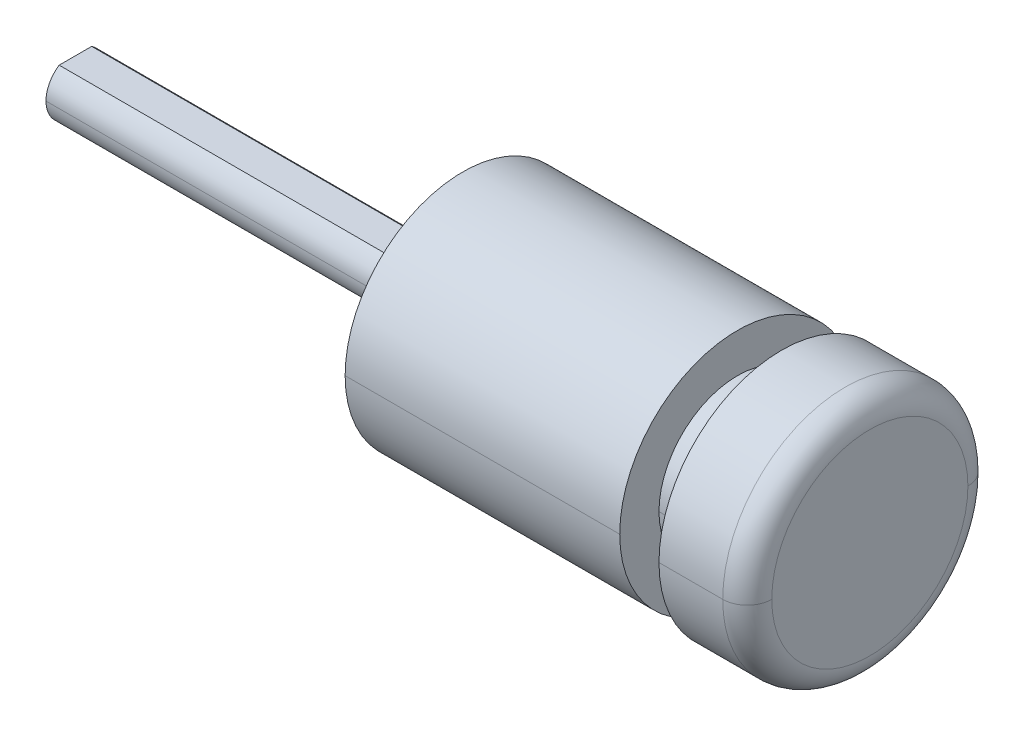
ISO-10303-21;
HEADER;
FILE_DESCRIPTION(('STEP AP214'),'2;1');
FILE_NAME('part.step','',(''),(''),'','','');
FILE_SCHEMA(('AUTOMOTIVE_DESIGN { 1 0 10303 214 1 1 1 1 }'));
ENDSEC;
DATA;
#1=APPLICATION_CONTEXT('core data for automotive mechanical design processes');
#2=APPLICATION_PROTOCOL_DEFINITION('international standard','automotive_design',2000,#1);
#3=PRODUCT_CONTEXT('',#1,'mechanical');
#4=PRODUCT('Part','Part','',(#3));
#5=PRODUCT_RELATED_PRODUCT_CATEGORY('part','',(#4));
#6=PRODUCT_DEFINITION_FORMATION('','',#4);
#7=PRODUCT_DEFINITION_CONTEXT('part definition',#1,'design');
#8=PRODUCT_DEFINITION('design','',#6,#7);
#9=PRODUCT_DEFINITION_SHAPE('','',#8);
#10=(LENGTH_UNIT() NAMED_UNIT(*) SI_UNIT(.MILLI.,.METRE.));
#11=(NAMED_UNIT(*) PLANE_ANGLE_UNIT() SI_UNIT($,.RADIAN.));
#12=(NAMED_UNIT(*) SI_UNIT($,.STERADIAN.) SOLID_ANGLE_UNIT());
#13=UNCERTAINTY_MEASURE_WITH_UNIT(LENGTH_MEASURE(1.E-05),#10,'distance_accuracy_value','');
#14=(GEOMETRIC_REPRESENTATION_CONTEXT(3) GLOBAL_UNCERTAINTY_ASSIGNED_CONTEXT((#13)) GLOBAL_UNIT_ASSIGNED_CONTEXT((#10,
#11,#12)) REPRESENTATION_CONTEXT('',''));
#15=CARTESIAN_POINT('',(0.,0.,0.));
#16=DIRECTION('',(0.,0.,1.));
#17=DIRECTION('',(1.,0.,0.));
#18=AXIS2_PLACEMENT_3D('',#15,#16,#17);
#19=CARTESIAN_POINT('',(-33.5,0.,0.));
#20=DIRECTION('',(-1.,0.,0.));
#21=DIRECTION('',(0.,0.,1.));
#22=AXIS2_PLACEMENT_3D('',#19,#20,#21);
#23=PLANE('',#22);
#24=CARTESIAN_POINT('',(-33.5,0.,0.));
#25=DIRECTION('',(-1.,0.,0.));
#26=DIRECTION('',(0.,0.,1.));
#27=AXIS2_PLACEMENT_3D('',#24,#25,#26);
#28=CIRCLE('',#27,3.);
#29=CARTESIAN_POINT('',(-33.5,2.5,1.6583123951777));
#30=VERTEX_POINT('',#29);
#31=CARTESIAN_POINT('',(-33.5,2.5,-1.6583123951777));
#32=VERTEX_POINT('',#31);
#33=EDGE_CURVE('E311',#30,#32,#28,.T.);
#34=ORIENTED_EDGE('',*,*,#33,.T.);
#35=DIRECTION('',(0.,0.,1.));
#36=VECTOR('',#35,1.);
#37=CARTESIAN_POINT('',(-33.5,2.5,-1.6583123951777));
#38=LINE('',#37,#36);
#39=EDGE_CURVE('E10',#32,#30,#38,.T.);
#40=ORIENTED_EDGE('',*,*,#39,.T.);
#41=EDGE_LOOP('',(#34,#40));
#42=FACE_BOUND('',#41,.T.);
#43=ADVANCED_FACE('F16',(#42),#23,.T.);
#44=CARTESIAN_POINT('',(-33.5,2.5,-1.6583123951777));
#45=DIRECTION('',(0.,-1.,0.));
#46=DIRECTION('',(0.,0.,-1.));
#47=AXIS2_PLACEMENT_3D('',#44,#45,#46);
#48=PLANE('',#47);
#49=DIRECTION('',(0.,0.,1.));
#50=VECTOR('',#49,1.);
#51=CARTESIAN_POINT('',(-67.5,2.5,-1.6583123951777));
#52=LINE('',#51,#50);
#53=CARTESIAN_POINT('',(-67.5,2.5,-1.6583123951777));
#54=VERTEX_POINT('',#53);
#55=CARTESIAN_POINT('',(-67.5,2.5,1.6583123951777));
#56=VERTEX_POINT('',#55);
#57=EDGE_CURVE('E109',#54,#56,#52,.T.);
#58=ORIENTED_EDGE('',*,*,#57,.T.);
#59=DIRECTION('',(-1.,0.,0.));
#60=VECTOR('',#59,1.);
#61=CARTESIAN_POINT('',(-33.5,2.5,1.6583123951777));
#62=LINE('',#61,#60);
#63=EDGE_CURVE('E315',#30,#56,#62,.T.);
#64=ORIENTED_EDGE('',*,*,#63,.F.);
#65=ORIENTED_EDGE('',*,*,#39,.F.);
#66=DIRECTION('',(-1.,0.,0.));
#67=VECTOR('',#66,1.);
#68=CARTESIAN_POINT('',(-33.5,2.5,-1.6583123951777));
#69=LINE('',#68,#67);
#70=EDGE_CURVE('E316',#32,#54,#69,.T.);
#71=ORIENTED_EDGE('',*,*,#70,.T.);
#72=EDGE_LOOP('',(#58,#64,#65,#71));
#73=FACE_BOUND('',#72,.T.);
#74=ADVANCED_FACE('F567',(#73),#48,.F.);
#75=CARTESIAN_POINT('',(11.,0.,0.));
#76=DIRECTION('',(1.,0.,0.));
#77=DIRECTION('',(0.,0.,-1.));
#78=AXIS2_PLACEMENT_3D('',#75,#76,#77);
#79=TOROIDAL_SURFACE('',#78,10.,2.5);
#80=CARTESIAN_POINT('',(11.,0.,10.));
#81=DIRECTION('',(0.,1.,0.));
#82=DIRECTION('',(0.,0.,1.));
#83=AXIS2_PLACEMENT_3D('',#80,#81,#82);
#84=CIRCLE('',#83,2.5);
#85=CARTESIAN_POINT('',(11.,0.,12.5));
#86=VERTEX_POINT('',#85);
#87=CARTESIAN_POINT('',(13.5,0.,10.));
#88=VERTEX_POINT('',#87);
#89=EDGE_CURVE('E202',#86,#88,#84,.T.);
#90=ORIENTED_EDGE('',*,*,#89,.F.);
#91=CARTESIAN_POINT('',(11.,0.,0.));
#92=DIRECTION('',(-1.,0.,0.));
#93=DIRECTION('',(0.,0.,-1.));
#94=AXIS2_PLACEMENT_3D('',#91,#92,#93);
#95=CIRCLE('',#94,12.5);
#96=CARTESIAN_POINT('',(11.,0.,-12.5));
#97=VERTEX_POINT('',#96);
#98=EDGE_CURVE('E152',#97,#86,#95,.T.);
#99=ORIENTED_EDGE('',*,*,#98,.F.);
#100=CARTESIAN_POINT('',(11.,0.,-10.));
#101=DIRECTION('',(0.,-1.,0.));
#102=DIRECTION('',(0.,0.,-1.));
#103=AXIS2_PLACEMENT_3D('',#100,#101,#102);
#104=CIRCLE('',#103,2.5);
#105=CARTESIAN_POINT('',(13.5,0.,-10.));
#106=VERTEX_POINT('',#105);
#107=EDGE_CURVE('E191',#97,#106,#104,.T.);
#108=ORIENTED_EDGE('',*,*,#107,.T.);
#109=CARTESIAN_POINT('',(13.5,0.,0.));
#110=DIRECTION('',(1.,0.,0.));
#111=DIRECTION('',(0.,0.,-1.));
#112=AXIS2_PLACEMENT_3D('',#109,#110,#111);
#113=CIRCLE('',#112,10.);
#114=EDGE_CURVE('E24',#88,#106,#113,.T.);
#115=ORIENTED_EDGE('',*,*,#114,.F.);
#116=EDGE_LOOP('',(#90,#99,#108,#115));
#117=FACE_BOUND('',#116,.T.);
#118=ADVANCED_FACE('F192',(#117),#79,.T.);
#119=CARTESIAN_POINT('',(13.5,0.,0.));
#120=DIRECTION('',(1.,0.,0.));
#121=DIRECTION('',(0.,1.,0.));
#122=AXIS2_PLACEMENT_3D('',#119,#120,#121);
#123=PLANE('',#122);
#124=CARTESIAN_POINT('',(13.5,0.,0.));
#125=DIRECTION('',(1.,0.,0.));
#126=DIRECTION('',(0.,0.,-1.));
#127=AXIS2_PLACEMENT_3D('',#124,#125,#126);
#128=CIRCLE('',#127,10.);
#129=EDGE_CURVE('E182',#106,#88,#128,.T.);
#130=ORIENTED_EDGE('',*,*,#129,.T.);
#131=ORIENTED_EDGE('',*,*,#114,.T.);
#132=EDGE_LOOP('',(#130,#131));
#133=FACE_BOUND('',#132,.T.);
#134=ADVANCED_FACE('F179',(#133),#123,.T.);
#135=CARTESIAN_POINT('',(4.5,0.,0.));
#136=DIRECTION('',(1.,0.,0.));
#137=DIRECTION('',(0.,1.,0.));
#138=AXIS2_PLACEMENT_3D('',#135,#136,#137);
#139=PLANE('',#138);
#140=CARTESIAN_POINT('',(4.5,0.,0.));
#141=DIRECTION('',(1.,0.,0.));
#142=DIRECTION('',(0.,0.,-1.));
#143=AXIS2_PLACEMENT_3D('',#140,#141,#142);
#144=CIRCLE('',#143,8.);
#145=CARTESIAN_POINT('',(4.5,0.,8.));
#146=VERTEX_POINT('',#145);
#147=CARTESIAN_POINT('',(4.5,0.,-8.));
#148=VERTEX_POINT('',#147);
#149=EDGE_CURVE('E164',#146,#148,#144,.T.);
#150=ORIENTED_EDGE('',*,*,#149,.T.);
#151=CARTESIAN_POINT('',(4.5,0.,0.));
#152=DIRECTION('',(1.,0.,0.));
#153=DIRECTION('',(0.,0.,-1.));
#154=AXIS2_PLACEMENT_3D('',#151,#152,#153);
#155=CIRCLE('',#154,8.);
#156=EDGE_CURVE('E228',#148,#146,#155,.T.);
#157=ORIENTED_EDGE('',*,*,#156,.T.);
#158=EDGE_LOOP('',(#150,#157));
#159=FACE_BOUND('',#158,.T.);
#160=CARTESIAN_POINT('',(4.5,0.,0.));
#161=DIRECTION('',(1.,0.,0.));
#162=DIRECTION('',(0.,0.,-1.));
#163=AXIS2_PLACEMENT_3D('',#160,#161,#162);
#164=CIRCLE('',#163,12.5);
#165=CARTESIAN_POINT('',(4.5,0.,-12.5));
#166=VERTEX_POINT('',#165);
#167=CARTESIAN_POINT('',(4.5,0.,12.5));
#168=VERTEX_POINT('',#167);
#169=EDGE_CURVE('E199',#166,#168,#164,.T.);
#170=ORIENTED_EDGE('',*,*,#169,.F.);
#171=CARTESIAN_POINT('',(4.5,0.,0.));
#172=DIRECTION('',(1.,0.,0.));
#173=DIRECTION('',(0.,0.,-1.));
#174=AXIS2_PLACEMENT_3D('',#171,#172,#173);
#175=CIRCLE('',#174,12.5);
#176=EDGE_CURVE('E156',#168,#166,#175,.T.);
#177=ORIENTED_EDGE('',*,*,#176,.F.);
#178=EDGE_LOOP('',(#170,#177));
#179=FACE_BOUND('',#178,.T.);
#180=ADVANCED_FACE('F623',(#159,#179),#139,.F.);
#181=CARTESIAN_POINT('',(4.5,0.,0.));
#182=DIRECTION('',(1.,0.,0.));
#183=DIRECTION('',(0.,0.,-1.));
#184=AXIS2_PLACEMENT_3D('',#181,#182,#183);
#185=CYLINDRICAL_SURFACE('',#184,12.5);
#186=DIRECTION('',(1.,0.,0.));
#187=VECTOR('',#186,1.);
#188=CARTESIAN_POINT('',(4.5,0.,12.5));
#189=LINE('',#188,#187);
#190=EDGE_CURVE('E222',#168,#86,#189,.T.);
#191=ORIENTED_EDGE('',*,*,#190,.F.);
#192=ORIENTED_EDGE('',*,*,#176,.T.);
#193=DIRECTION('',(1.,0.,0.));
#194=VECTOR('',#193,1.);
#195=CARTESIAN_POINT('',(4.5,0.,-12.5));
#196=LINE('',#195,#194);
#197=EDGE_CURVE('E232',#166,#97,#196,.T.);
#198=ORIENTED_EDGE('',*,*,#197,.T.);
#199=ORIENTED_EDGE('',*,*,#98,.T.);
#200=EDGE_LOOP('',(#191,#192,#198,#199));
#201=FACE_BOUND('',#200,.T.);
#202=ADVANCED_FACE('F619',(#201),#185,.T.);
#203=CARTESIAN_POINT('',(13.502,0.,0.));
#204=DIRECTION('',(-1.,0.,0.));
#205=DIRECTION('',(0.,0.,1.));
#206=AXIS2_PLACEMENT_3D('',#203,#204,#205);
#207=CYLINDRICAL_SURFACE('',#206,8.);
#208=DIRECTION('',(-1.,0.,0.));
#209=VECTOR('',#208,1.);
#210=CARTESIAN_POINT('',(13.502,0.,-8.));
#211=LINE('',#210,#209);
#212=CARTESIAN_POINT('',(0.,0.,-8.));
#213=VERTEX_POINT('',#212);
#214=EDGE_CURVE('E223',#148,#213,#211,.T.);
#215=ORIENTED_EDGE('',*,*,#214,.F.);
#216=ORIENTED_EDGE('',*,*,#149,.F.);
#217=DIRECTION('',(-1.,0.,0.));
#218=VECTOR('',#217,1.);
#219=CARTESIAN_POINT('',(13.502,0.,8.));
#220=LINE('',#219,#218);
#221=CARTESIAN_POINT('',(0.,0.,8.));
#222=VERTEX_POINT('',#221);
#223=EDGE_CURVE('E238',#146,#222,#220,.T.);
#224=ORIENTED_EDGE('',*,*,#223,.T.);
#225=CARTESIAN_POINT('',(0.,0.,0.));
#226=DIRECTION('',(1.,0.,0.));
#227=DIRECTION('',(0.,0.,-1.));
#228=AXIS2_PLACEMENT_3D('',#225,#226,#227);
#229=CIRCLE('',#228,8.);
#230=EDGE_CURVE('E80',#222,#213,#229,.T.);
#231=ORIENTED_EDGE('',*,*,#230,.T.);
#232=EDGE_LOOP('',(#215,#216,#224,#231));
#233=FACE_BOUND('',#232,.T.);
#234=ADVANCED_FACE('F622',(#233),#207,.T.);
#235=CARTESIAN_POINT('',(-22.,9.,0.));
#236=DIRECTION('',(-1.,0.,0.));
#237=DIRECTION('',(0.,0.,1.));
#238=AXIS2_PLACEMENT_3D('',#235,#236,#237);
#239=PLANE('',#238);
#240=CARTESIAN_POINT('',(-22.,9.,0.));
#241=DIRECTION('',(-1.,0.,0.));
#242=DIRECTION('',(0.,0.,1.));
#243=AXIS2_PLACEMENT_3D('',#240,#241,#242);
#244=CIRCLE('',#243,1.);
#245=CARTESIAN_POINT('',(-22.,9.,1.));
#246=VERTEX_POINT('',#245);
#247=CARTESIAN_POINT('',(-22.,9.,-1.));
#248=VERTEX_POINT('',#247);
#249=EDGE_CURVE('E160',#246,#248,#244,.T.);
#250=ORIENTED_EDGE('',*,*,#249,.T.);
#251=CARTESIAN_POINT('',(-22.,9.,0.));
#252=DIRECTION('',(-1.,0.,0.));
#253=DIRECTION('',(0.,0.,1.));
#254=AXIS2_PLACEMENT_3D('',#251,#252,#253);
#255=CIRCLE('',#254,1.);
#256=EDGE_CURVE('E212',#248,#246,#255,.T.);
#257=ORIENTED_EDGE('',*,*,#256,.T.);
#258=EDGE_LOOP('',(#250,#257));
#259=FACE_BOUND('',#258,.T.);
#260=ADVANCED_FACE('F627',(#259),#239,.T.);
#261=CARTESIAN_POINT('',(-22.,9.,0.));
#262=DIRECTION('',(-1.,0.,0.));
#263=DIRECTION('',(0.,0.,1.));
#264=AXIS2_PLACEMENT_3D('',#261,#262,#263);
#265=CYLINDRICAL_SURFACE('',#264,1.);
#266=DIRECTION('',(-1.,0.,0.));
#267=VECTOR('',#266,1.);
#268=CARTESIAN_POINT('',(-22.,9.,-1.));
#269=LINE('',#268,#267);
#270=CARTESIAN_POINT('',(-28.,9.,-1.));
#271=VERTEX_POINT('',#270);
#272=EDGE_CURVE('E251',#248,#271,#269,.T.);
#273=ORIENTED_EDGE('',*,*,#272,.F.);
#274=ORIENTED_EDGE('',*,*,#249,.F.);
#275=DIRECTION('',(-1.,0.,0.));
#276=VECTOR('',#275,1.);
#277=CARTESIAN_POINT('',(-22.,9.,1.));
#278=LINE('',#277,#276);
#279=CARTESIAN_POINT('',(-28.,9.,1.));
#280=VERTEX_POINT('',#279);
#281=EDGE_CURVE('E256',#246,#280,#278,.T.);
#282=ORIENTED_EDGE('',*,*,#281,.T.);
#283=CARTESIAN_POINT('',(-28.,9.,0.));
#284=DIRECTION('',(-1.,0.,0.));
#285=DIRECTION('',(0.,0.,1.));
#286=AXIS2_PLACEMENT_3D('',#283,#284,#285);
#287=CIRCLE('',#286,1.);
#288=EDGE_CURVE('E79',#280,#271,#287,.T.);
#289=ORIENTED_EDGE('',*,*,#288,.T.);
#290=EDGE_LOOP('',(#273,#274,#282,#289));
#291=FACE_BOUND('',#290,.T.);
#292=ADVANCED_FACE('F505',(#291),#265,.F.);
#293=CARTESIAN_POINT('',(-22.,0.,9.));
#294=DIRECTION('',(-1.,0.,0.));
#295=DIRECTION('',(0.,0.,1.));
#296=AXIS2_PLACEMENT_3D('',#293,#294,#295);
#297=PLANE('',#296);
#298=CARTESIAN_POINT('',(-22.,0.,9.));
#299=DIRECTION('',(-1.,0.,0.));
#300=DIRECTION('',(0.,0.,1.));
#301=AXIS2_PLACEMENT_3D('',#298,#299,#300);
#302=CIRCLE('',#301,1.);
#303=CARTESIAN_POINT('',(-22.,0.,10.));
#304=VERTEX_POINT('',#303);
#305=CARTESIAN_POINT('',(-22.,0.,8.));
#306=VERTEX_POINT('',#305);
#307=EDGE_CURVE('E137',#304,#306,#302,.T.);
#308=ORIENTED_EDGE('',*,*,#307,.T.);
#309=CARTESIAN_POINT('',(-22.,0.,9.));
#310=DIRECTION('',(-1.,0.,0.));
#311=DIRECTION('',(0.,0.,1.));
#312=AXIS2_PLACEMENT_3D('',#309,#310,#311);
#313=CIRCLE('',#312,1.);
#314=EDGE_CURVE('E260',#306,#304,#313,.T.);
#315=ORIENTED_EDGE('',*,*,#314,.T.);
#316=EDGE_LOOP('',(#308,#315));
#317=FACE_BOUND('',#316,.T.);
#318=ADVANCED_FACE('F542',(#317),#297,.T.);
#319=CARTESIAN_POINT('',(-22.,0.,9.));
#320=DIRECTION('',(-1.,0.,0.));
#321=DIRECTION('',(0.,0.,1.));
#322=AXIS2_PLACEMENT_3D('',#319,#320,#321);
#323=CYLINDRICAL_SURFACE('',#322,1.);
#324=DIRECTION('',(-1.,0.,0.));
#325=VECTOR('',#324,1.);
#326=CARTESIAN_POINT('',(-22.,0.,8.));
#327=LINE('',#326,#325);
#328=CARTESIAN_POINT('',(-28.,0.,8.));
#329=VERTEX_POINT('',#328);
#330=EDGE_CURVE('E250',#306,#329,#327,.T.);
#331=ORIENTED_EDGE('',*,*,#330,.F.);
#332=ORIENTED_EDGE('',*,*,#307,.F.);
#333=DIRECTION('',(-1.,0.,0.));
#334=VECTOR('',#333,1.);
#335=CARTESIAN_POINT('',(-22.,0.,10.));
#336=LINE('',#335,#334);
#337=CARTESIAN_POINT('',(-28.,0.,10.));
#338=VERTEX_POINT('',#337);
#339=EDGE_CURVE('E249',#304,#338,#336,.T.);
#340=ORIENTED_EDGE('',*,*,#339,.T.);
#341=CARTESIAN_POINT('',(-28.,0.,9.));
#342=DIRECTION('',(-1.,0.,0.));
#343=DIRECTION('',(0.,0.,1.));
#344=AXIS2_PLACEMENT_3D('',#341,#342,#343);
#345=CIRCLE('',#344,1.);
#346=EDGE_CURVE('E118',#338,#329,#345,.T.);
#347=ORIENTED_EDGE('',*,*,#346,.T.);
#348=EDGE_LOOP('',(#331,#332,#340,#347));
#349=FACE_BOUND('',#348,.T.);
#350=ADVANCED_FACE('F549',(#349),#323,.F.);
#351=CARTESIAN_POINT('',(-22.,-9.,0.));
#352=DIRECTION('',(-1.,0.,0.));
#353=DIRECTION('',(0.,0.,1.));
#354=AXIS2_PLACEMENT_3D('',#351,#352,#353);
#355=PLANE('',#354);
#356=CARTESIAN_POINT('',(-22.,-9.,0.));
#357=DIRECTION('',(-1.,0.,0.));
#358=DIRECTION('',(0.,0.,1.));
#359=AXIS2_PLACEMENT_3D('',#356,#357,#358);
#360=CIRCLE('',#359,1.);
#361=CARTESIAN_POINT('',(-22.,-9.,1.));
#362=VERTEX_POINT('',#361);
#363=CARTESIAN_POINT('',(-22.,-9.,-1.));
#364=VERTEX_POINT('',#363);
#365=EDGE_CURVE('E133',#362,#364,#360,.T.);
#366=ORIENTED_EDGE('',*,*,#365,.T.);
#367=CARTESIAN_POINT('',(-22.,-9.,0.));
#368=DIRECTION('',(-1.,0.,0.));
#369=DIRECTION('',(0.,0.,1.));
#370=AXIS2_PLACEMENT_3D('',#367,#368,#369);
#371=CIRCLE('',#370,1.);
#372=EDGE_CURVE('E270',#364,#362,#371,.T.);
#373=ORIENTED_EDGE('',*,*,#372,.T.);
#374=EDGE_LOOP('',(#366,#373));
#375=FACE_BOUND('',#374,.T.);
#376=ADVANCED_FACE('F610',(#375),#355,.T.);
#377=CARTESIAN_POINT('',(-22.,-9.,0.));
#378=DIRECTION('',(-1.,0.,0.));
#379=DIRECTION('',(0.,0.,1.));
#380=AXIS2_PLACEMENT_3D('',#377,#378,#379);
#381=CYLINDRICAL_SURFACE('',#380,1.);
#382=DIRECTION('',(-1.,0.,0.));
#383=VECTOR('',#382,1.);
#384=CARTESIAN_POINT('',(-22.,-9.,-1.));
#385=LINE('',#384,#383);
#386=CARTESIAN_POINT('',(-28.,-9.,-1.));
#387=VERTEX_POINT('',#386);
#388=EDGE_CURVE('E274',#364,#387,#385,.T.);
#389=ORIENTED_EDGE('',*,*,#388,.F.);
#390=ORIENTED_EDGE('',*,*,#365,.F.);
#391=DIRECTION('',(-1.,0.,0.));
#392=VECTOR('',#391,1.);
#393=CARTESIAN_POINT('',(-22.,-9.,1.));
#394=LINE('',#393,#392);
#395=CARTESIAN_POINT('',(-28.,-9.,1.));
#396=VERTEX_POINT('',#395);
#397=EDGE_CURVE('E288',#362,#396,#394,.T.);
#398=ORIENTED_EDGE('',*,*,#397,.T.);
#399=CARTESIAN_POINT('',(-28.,-9.,0.));
#400=DIRECTION('',(-1.,0.,0.));
#401=DIRECTION('',(0.,0.,1.));
#402=AXIS2_PLACEMENT_3D('',#399,#400,#401);
#403=CIRCLE('',#402,1.);
#404=EDGE_CURVE('E122',#396,#387,#403,.T.);
#405=ORIENTED_EDGE('',*,*,#404,.T.);
#406=EDGE_LOOP('',(#389,#390,#398,#405));
#407=FACE_BOUND('',#406,.T.);
#408=ADVANCED_FACE('F606',(#407),#381,.F.);
#409=CARTESIAN_POINT('',(-22.,0.,-9.));
#410=DIRECTION('',(-1.,0.,0.));
#411=DIRECTION('',(0.,0.,1.));
#412=AXIS2_PLACEMENT_3D('',#409,#410,#411);
#413=PLANE('',#412);
#414=CARTESIAN_POINT('',(-22.,0.,-9.));
#415=DIRECTION('',(-1.,0.,0.));
#416=DIRECTION('',(0.,0.,1.));
#417=AXIS2_PLACEMENT_3D('',#414,#415,#416);
#418=CIRCLE('',#417,1.);
#419=CARTESIAN_POINT('',(-22.,0.,-8.));
#420=VERTEX_POINT('',#419);
#421=CARTESIAN_POINT('',(-22.,0.,-10.));
#422=VERTEX_POINT('',#421);
#423=EDGE_CURVE('E113',#420,#422,#418,.T.);
#424=ORIENTED_EDGE('',*,*,#423,.T.);
#425=CARTESIAN_POINT('',(-22.,0.,-9.));
#426=DIRECTION('',(-1.,0.,0.));
#427=DIRECTION('',(0.,0.,1.));
#428=AXIS2_PLACEMENT_3D('',#425,#426,#427);
#429=CIRCLE('',#428,1.);
#430=EDGE_CURVE('E292',#422,#420,#429,.T.);
#431=ORIENTED_EDGE('',*,*,#430,.T.);
#432=EDGE_LOOP('',(#424,#431));
#433=FACE_BOUND('',#432,.T.);
#434=ADVANCED_FACE('F603',(#433),#413,.T.);
#435=CARTESIAN_POINT('',(-22.,0.,-9.));
#436=DIRECTION('',(-1.,0.,0.));
#437=DIRECTION('',(0.,0.,1.));
#438=AXIS2_PLACEMENT_3D('',#435,#436,#437);
#439=CYLINDRICAL_SURFACE('',#438,1.);
#440=DIRECTION('',(-1.,0.,0.));
#441=VECTOR('',#440,1.);
#442=CARTESIAN_POINT('',(-22.,0.,-10.));
#443=LINE('',#442,#441);
#444=CARTESIAN_POINT('',(-28.,0.,-10.));
#445=VERTEX_POINT('',#444);
#446=EDGE_CURVE('E296',#422,#445,#443,.T.);
#447=ORIENTED_EDGE('',*,*,#446,.F.);
#448=ORIENTED_EDGE('',*,*,#423,.F.);
#449=DIRECTION('',(-1.,0.,0.));
#450=VECTOR('',#449,1.);
#451=CARTESIAN_POINT('',(-22.,0.,-8.));
#452=LINE('',#451,#450);
#453=CARTESIAN_POINT('',(-28.,0.,-8.));
#454=VERTEX_POINT('',#453);
#455=EDGE_CURVE('E305',#420,#454,#452,.T.);
#456=ORIENTED_EDGE('',*,*,#455,.T.);
#457=CARTESIAN_POINT('',(-28.,0.,-9.));
#458=DIRECTION('',(-1.,0.,0.));
#459=DIRECTION('',(0.,0.,1.));
#460=AXIS2_PLACEMENT_3D('',#457,#458,#459);
#461=CIRCLE('',#460,1.);
#462=EDGE_CURVE('E106',#454,#445,#461,.T.);
#463=ORIENTED_EDGE('',*,*,#462,.T.);
#464=EDGE_LOOP('',(#447,#448,#456,#463));
#465=FACE_BOUND('',#464,.T.);
#466=ADVANCED_FACE('F602',(#465),#439,.F.);
#467=CARTESIAN_POINT('',(-67.5,3.,0.));
#468=DIRECTION('',(-1.,0.,0.));
#469=DIRECTION('',(0.,0.,1.));
#470=AXIS2_PLACEMENT_3D('',#467,#468,#469);
#471=PLANE('',#470);
#472=ORIENTED_EDGE('',*,*,#57,.F.);
#473=CARTESIAN_POINT('',(-67.5,0.,0.));
#474=DIRECTION('',(1.,0.,0.));
#475=DIRECTION('',(0.,0.,-1.));
#476=AXIS2_PLACEMENT_3D('',#473,#474,#475);
#477=CIRCLE('',#476,3.);
#478=CARTESIAN_POINT('',(-67.5,0.,-3.));
#479=VERTEX_POINT('',#478);
#480=EDGE_CURVE('E330',#479,#54,#477,.T.);
#481=ORIENTED_EDGE('',*,*,#480,.F.);
#482=CARTESIAN_POINT('',(-67.5,0.,0.));
#483=DIRECTION('',(1.,0.,0.));
#484=DIRECTION('',(0.,0.,-1.));
#485=AXIS2_PLACEMENT_3D('',#482,#483,#484);
#486=CIRCLE('',#485,3.);
#487=CARTESIAN_POINT('',(-67.5,0.,3.));
#488=VERTEX_POINT('',#487);
#489=EDGE_CURVE('E114',#488,#479,#486,.T.);
#490=ORIENTED_EDGE('',*,*,#489,.F.);
#491=CARTESIAN_POINT('',(-67.5,0.,0.));
#492=DIRECTION('',(1.,0.,0.));
#493=DIRECTION('',(0.,0.,-1.));
#494=AXIS2_PLACEMENT_3D('',#491,#492,#493);
#495=CIRCLE('',#494,3.);
#496=EDGE_CURVE('E284',#56,#488,#495,.T.);
#497=ORIENTED_EDGE('',*,*,#496,.F.);
#498=EDGE_LOOP('',(#472,#481,#490,#497));
#499=FACE_BOUND('',#498,.T.);
#500=ADVANCED_FACE('F582',(#499),#471,.T.);
#501=CARTESIAN_POINT('',(0.,0.,0.));
#502=DIRECTION('',(1.,0.,0.));
#503=DIRECTION('',(0.,0.,-1.));
#504=AXIS2_PLACEMENT_3D('',#501,#502,#503);
#505=CYLINDRICAL_SURFACE('',#504,3.);
#506=DIRECTION('',(1.,0.,0.));
#507=VECTOR('',#506,1.);
#508=CARTESIAN_POINT('',(0.,0.,3.));
#509=LINE('',#508,#507);
#510=CARTESIAN_POINT('',(-30.,0.,3.));
#511=VERTEX_POINT('',#510);
#512=EDGE_CURVE('E279',#488,#511,#509,.T.);
#513=ORIENTED_EDGE('',*,*,#512,.F.);
#514=ORIENTED_EDGE('',*,*,#489,.T.);
#515=DIRECTION('',(1.,0.,0.));
#516=VECTOR('',#515,1.);
#517=CARTESIAN_POINT('',(0.,0.,-3.));
#518=LINE('',#517,#516);
#519=CARTESIAN_POINT('',(-30.,0.,-3.));
#520=VERTEX_POINT('',#519);
#521=EDGE_CURVE('E323',#479,#520,#518,.T.);
#522=ORIENTED_EDGE('',*,*,#521,.T.);
#523=CARTESIAN_POINT('',(-30.,0.,0.));
#524=DIRECTION('',(1.,0.,0.));
#525=DIRECTION('',(0.,0.,-1.));
#526=AXIS2_PLACEMENT_3D('',#523,#524,#525);
#527=CIRCLE('',#526,3.);
#528=EDGE_CURVE('E126',#511,#520,#527,.T.);
#529=ORIENTED_EDGE('',*,*,#528,.F.);
#530=EDGE_LOOP('',(#513,#514,#522,#529));
#531=FACE_BOUND('',#530,.T.);
#532=ADVANCED_FACE('F585',(#531),#505,.T.);
#533=CARTESIAN_POINT('',(-30.,5.,0.));
#534=DIRECTION('',(-1.,0.,0.));
#535=DIRECTION('',(0.,0.,1.));
#536=AXIS2_PLACEMENT_3D('',#533,#534,#535);
#537=PLANE('',#536);
#538=CARTESIAN_POINT('',(-30.,0.,0.));
#539=DIRECTION('',(1.,0.,0.));
#540=DIRECTION('',(0.,0.,-1.));
#541=AXIS2_PLACEMENT_3D('',#538,#539,#540);
#542=CIRCLE('',#541,3.);
#543=EDGE_CURVE('E283',#520,#511,#542,.T.);
#544=ORIENTED_EDGE('',*,*,#543,.T.);
#545=ORIENTED_EDGE('',*,*,#528,.T.);
#546=EDGE_LOOP('',(#544,#545));
#547=FACE_BOUND('',#546,.T.);
#548=CARTESIAN_POINT('',(-30.,0.,0.));
#549=DIRECTION('',(1.,0.,0.));
#550=DIRECTION('',(0.,0.,-1.));
#551=AXIS2_PLACEMENT_3D('',#548,#549,#550);
#552=CIRCLE('',#551,5.);
#553=CARTESIAN_POINT('',(-30.,0.,-5.));
#554=VERTEX_POINT('',#553);
#555=CARTESIAN_POINT('',(-30.,0.,5.));
#556=VERTEX_POINT('',#555);
#557=EDGE_CURVE('E340',#554,#556,#552,.T.);
#558=ORIENTED_EDGE('',*,*,#557,.F.);
#559=CARTESIAN_POINT('',(-30.,0.,0.));
#560=DIRECTION('',(1.,0.,0.));
#561=DIRECTION('',(0.,0.,-1.));
#562=AXIS2_PLACEMENT_3D('',#559,#560,#561);
#563=CIRCLE('',#562,5.);
#564=EDGE_CURVE('E142',#556,#554,#563,.T.);
#565=ORIENTED_EDGE('',*,*,#564,.F.);
#566=EDGE_LOOP('',(#558,#565));
#567=FACE_BOUND('',#566,.T.);
#568=ADVANCED_FACE('F588',(#547,#567),#537,.T.);
#569=CARTESIAN_POINT('',(0.,0.,0.));
#570=DIRECTION('',(1.,0.,0.));
#571=DIRECTION('',(0.,0.,-1.));
#572=AXIS2_PLACEMENT_3D('',#569,#570,#571);
#573=CYLINDRICAL_SURFACE('',#572,5.);
#574=DIRECTION('',(1.,0.,0.));
#575=VECTOR('',#574,1.);
#576=CARTESIAN_POINT('',(0.,0.,5.));
#577=LINE('',#576,#575);
#578=CARTESIAN_POINT('',(-29.5,0.,5.));
#579=VERTEX_POINT('',#578);
#580=EDGE_CURVE('E347',#556,#579,#577,.T.);
#581=ORIENTED_EDGE('',*,*,#580,.F.);
#582=ORIENTED_EDGE('',*,*,#564,.T.);
#583=DIRECTION('',(1.,0.,0.));
#584=VECTOR('',#583,1.);
#585=CARTESIAN_POINT('',(0.,0.,-5.));
#586=LINE('',#585,#584);
#587=CARTESIAN_POINT('',(-29.5,0.,-5.));
#588=VERTEX_POINT('',#587);
#589=EDGE_CURVE('E344',#554,#588,#586,.T.);
#590=ORIENTED_EDGE('',*,*,#589,.T.);
#591=CARTESIAN_POINT('',(-29.5,0.,0.));
#592=DIRECTION('',(1.,0.,0.));
#593=DIRECTION('',(0.,0.,-1.));
#594=AXIS2_PLACEMENT_3D('',#591,#592,#593);
#595=CIRCLE('',#594,5.);
#596=EDGE_CURVE('E141',#579,#588,#595,.T.);
#597=ORIENTED_EDGE('',*,*,#596,.F.);
#598=EDGE_LOOP('',(#581,#582,#590,#597));
#599=FACE_BOUND('',#598,.T.);
#600=ADVANCED_FACE('F368',(#599),#573,.T.);
#601=CARTESIAN_POINT('',(-29.5,7.,0.));
#602=DIRECTION('',(-1.,0.,0.));
#603=DIRECTION('',(0.,0.,1.));
#604=AXIS2_PLACEMENT_3D('',#601,#602,#603);
#605=PLANE('',#604);
#606=CARTESIAN_POINT('',(-29.5,0.,0.));
#607=DIRECTION('',(1.,0.,0.));
#608=DIRECTION('',(0.,0.,-1.));
#609=AXIS2_PLACEMENT_3D('',#606,#607,#608);
#610=CIRCLE('',#609,5.);
#611=EDGE_CURVE('E352',#588,#579,#610,.T.);
#612=ORIENTED_EDGE('',*,*,#611,.T.);
#613=ORIENTED_EDGE('',*,*,#596,.T.);
#614=EDGE_LOOP('',(#612,#613));
#615=FACE_BOUND('',#614,.T.);
#616=CARTESIAN_POINT('',(-29.5,0.,0.));
#617=DIRECTION('',(1.,0.,0.));
#618=DIRECTION('',(0.,0.,-1.));
#619=AXIS2_PLACEMENT_3D('',#616,#617,#618);
#620=CIRCLE('',#619,7.);
#621=CARTESIAN_POINT('',(-29.5,0.,-7.));
#622=VERTEX_POINT('',#621);
#623=CARTESIAN_POINT('',(-29.5,0.,7.));
#624=VERTEX_POINT('',#623);
#625=EDGE_CURVE('E300',#622,#624,#620,.T.);
#626=ORIENTED_EDGE('',*,*,#625,.F.);
#627=CARTESIAN_POINT('',(-29.5,0.,0.));
#628=DIRECTION('',(1.,0.,0.));
#629=DIRECTION('',(0.,0.,-1.));
#630=AXIS2_PLACEMENT_3D('',#627,#628,#629);
#631=CIRCLE('',#630,7.);
#632=EDGE_CURVE('E105',#624,#622,#631,.T.);
#633=ORIENTED_EDGE('',*,*,#632,.F.);
#634=EDGE_LOOP('',(#626,#633));
#635=FACE_BOUND('',#634,.T.);
#636=ADVANCED_FACE('F377',(#615,#635),#605,.T.);
#637=CARTESIAN_POINT('',(0.,0.,0.));
#638=DIRECTION('',(1.,0.,0.));
#639=DIRECTION('',(0.,0.,-1.));
#640=AXIS2_PLACEMENT_3D('',#637,#638,#639);
#641=CYLINDRICAL_SURFACE('',#640,7.);
#642=DIRECTION('',(1.,0.,0.));
#643=VECTOR('',#642,1.);
#644=CARTESIAN_POINT('',(0.,0.,7.));
#645=LINE('',#644,#643);
#646=CARTESIAN_POINT('',(-28.,0.,7.));
#647=VERTEX_POINT('',#646);
#648=EDGE_CURVE('E218',#624,#647,#645,.T.);
#649=ORIENTED_EDGE('',*,*,#648,.F.);
#650=ORIENTED_EDGE('',*,*,#632,.T.);
#651=DIRECTION('',(1.,0.,0.));
#652=VECTOR('',#651,1.);
#653=CARTESIAN_POINT('',(0.,0.,-7.));
#654=LINE('',#653,#652);
#655=CARTESIAN_POINT('',(-28.,0.,-7.));
#656=VERTEX_POINT('',#655);
#657=EDGE_CURVE('E90',#622,#656,#654,.T.);
#658=ORIENTED_EDGE('',*,*,#657,.T.);
#659=CARTESIAN_POINT('',(-28.,0.,0.));
#660=DIRECTION('',(1.,0.,0.));
#661=DIRECTION('',(0.,0.,-1.));
#662=AXIS2_PLACEMENT_3D('',#659,#660,#661);
#663=CIRCLE('',#662,7.);
#664=EDGE_CURVE('E102',#647,#656,#663,.T.);
#665=ORIENTED_EDGE('',*,*,#664,.F.);
#666=EDGE_LOOP('',(#649,#650,#658,#665));
#667=FACE_BOUND('',#666,.T.);
#668=ADVANCED_FACE('F552',(#667),#641,.T.);
#669=CARTESIAN_POINT('',(-28.,12.,0.));
#670=DIRECTION('',(-1.,0.,0.));
#671=DIRECTION('',(0.,0.,1.));
#672=AXIS2_PLACEMENT_3D('',#669,#670,#671);
#673=PLANE('',#672);
#674=CARTESIAN_POINT('',(-28.,0.,0.));
#675=DIRECTION('',(1.,0.,0.));
#676=DIRECTION('',(0.,0.,-1.));
#677=AXIS2_PLACEMENT_3D('',#674,#675,#676);
#678=CIRCLE('',#677,7.);
#679=EDGE_CURVE('E98',#656,#647,#678,.T.);
#680=ORIENTED_EDGE('',*,*,#679,.T.);
#681=ORIENTED_EDGE('',*,*,#664,.T.);
#682=EDGE_LOOP('',(#680,#681));
#683=FACE_BOUND('',#682,.T.);
#684=ORIENTED_EDGE('',*,*,#462,.F.);
#685=CARTESIAN_POINT('',(-28.,0.,-9.));
#686=DIRECTION('',(-1.,0.,0.));
#687=DIRECTION('',(0.,0.,1.));
#688=AXIS2_PLACEMENT_3D('',#685,#686,#687);
#689=CIRCLE('',#688,1.);
#690=EDGE_CURVE('E301',#445,#454,#689,.T.);
#691=ORIENTED_EDGE('',*,*,#690,.F.);
#692=EDGE_LOOP('',(#684,#691));
#693=FACE_BOUND('',#692,.T.);
#694=ORIENTED_EDGE('',*,*,#404,.F.);
#695=CARTESIAN_POINT('',(-28.,-9.,0.));
#696=DIRECTION('',(-1.,0.,0.));
#697=DIRECTION('',(0.,0.,1.));
#698=AXIS2_PLACEMENT_3D('',#695,#696,#697);
#699=CIRCLE('',#698,1.);
#700=EDGE_CURVE('E278',#387,#396,#699,.T.);
#701=ORIENTED_EDGE('',*,*,#700,.F.);
#702=EDGE_LOOP('',(#694,#701));
#703=FACE_BOUND('',#702,.T.);
#704=ORIENTED_EDGE('',*,*,#346,.F.);
#705=CARTESIAN_POINT('',(-28.,0.,9.));
#706=DIRECTION('',(-1.,0.,0.));
#707=DIRECTION('',(0.,0.,1.));
#708=AXIS2_PLACEMENT_3D('',#705,#706,#707);
#709=CIRCLE('',#708,1.);
#710=EDGE_CURVE('E245',#329,#338,#709,.T.);
#711=ORIENTED_EDGE('',*,*,#710,.F.);
#712=EDGE_LOOP('',(#704,#711));
#713=FACE_BOUND('',#712,.T.);
#714=ORIENTED_EDGE('',*,*,#288,.F.);
#715=CARTESIAN_POINT('',(-28.,9.,0.));
#716=DIRECTION('',(-1.,0.,0.));
#717=DIRECTION('',(0.,0.,1.));
#718=AXIS2_PLACEMENT_3D('',#715,#716,#717);
#719=CIRCLE('',#718,1.);
#720=EDGE_CURVE('E255',#271,#280,#719,.T.);
#721=ORIENTED_EDGE('',*,*,#720,.F.);
#722=EDGE_LOOP('',(#714,#721));
#723=FACE_BOUND('',#722,.T.);
#724=CARTESIAN_POINT('',(-28.,0.,0.));
#725=DIRECTION('',(1.,0.,0.));
#726=DIRECTION('',(0.,0.,-1.));
#727=AXIS2_PLACEMENT_3D('',#724,#725,#726);
#728=CIRCLE('',#727,12.);
#729=CARTESIAN_POINT('',(-28.,0.,-12.));
#730=VERTEX_POINT('',#729);
#731=CARTESIAN_POINT('',(-28.,0.,12.));
#732=VERTEX_POINT('',#731);
#733=EDGE_CURVE('E84',#730,#732,#728,.T.);
#734=ORIENTED_EDGE('',*,*,#733,.F.);
#735=CARTESIAN_POINT('',(-28.,0.,0.));
#736=DIRECTION('',(1.,0.,0.));
#737=DIRECTION('',(0.,0.,-1.));
#738=AXIS2_PLACEMENT_3D('',#735,#736,#737);
#739=CIRCLE('',#738,12.);
#740=EDGE_CURVE('E68',#732,#730,#739,.T.);
#741=ORIENTED_EDGE('',*,*,#740,.F.);
#742=EDGE_LOOP('',(#734,#741));
#743=FACE_BOUND('',#742,.T.);
#744=ADVANCED_FACE('F88',(#683,#693,#703,#713,#723,#743),#673,.T.);
#745=CARTESIAN_POINT('',(0.,0.,0.));
#746=DIRECTION('',(1.,0.,0.));
#747=DIRECTION('',(0.,0.,-1.));
#748=AXIS2_PLACEMENT_3D('',#745,#746,#747);
#749=CYLINDRICAL_SURFACE('',#748,12.);
#750=DIRECTION('',(1.,0.,0.));
#751=VECTOR('',#750,1.);
#752=CARTESIAN_POINT('',(0.,0.,12.));
#753=LINE('',#752,#751);
#754=CARTESIAN_POINT('',(0.,0.,12.));
#755=VERTEX_POINT('',#754);
#756=EDGE_CURVE('E74',#732,#755,#753,.T.);
#757=ORIENTED_EDGE('',*,*,#756,.F.);
#758=ORIENTED_EDGE('',*,*,#740,.T.);
#759=DIRECTION('',(1.,0.,0.));
#760=VECTOR('',#759,1.);
#761=CARTESIAN_POINT('',(0.,0.,-12.));
#762=LINE('',#761,#760);
#763=CARTESIAN_POINT('',(0.,0.,-12.));
#764=VERTEX_POINT('',#763);
#765=EDGE_CURVE('E71',#730,#764,#762,.T.);
#766=ORIENTED_EDGE('',*,*,#765,.T.);
#767=CARTESIAN_POINT('',(0.,0.,0.));
#768=DIRECTION('',(1.,0.,0.));
#769=DIRECTION('',(0.,0.,-1.));
#770=AXIS2_PLACEMENT_3D('',#767,#768,#769);
#771=CIRCLE('',#770,12.);
#772=EDGE_CURVE('E36',#755,#764,#771,.T.);
#773=ORIENTED_EDGE('',*,*,#772,.F.);
#774=EDGE_LOOP('',(#757,#758,#766,#773));
#775=FACE_BOUND('',#774,.T.);
#776=ADVANCED_FACE('F70',(#775),#749,.T.);
#777=CARTESIAN_POINT('',(0.,0.,0.));
#778=DIRECTION('',(1.,0.,0.));
#779=DIRECTION('',(0.,1.,0.));
#780=AXIS2_PLACEMENT_3D('',#777,#778,#779);
#781=PLANE('',#780);
#782=ORIENTED_EDGE('',*,*,#230,.F.);
#783=CARTESIAN_POINT('',(0.,0.,0.));
#784=DIRECTION('',(1.,0.,0.));
#785=DIRECTION('',(0.,0.,-1.));
#786=AXIS2_PLACEMENT_3D('',#783,#784,#785);
#787=CIRCLE('',#786,8.);
#788=EDGE_CURVE('E227',#213,#222,#787,.T.);
#789=ORIENTED_EDGE('',*,*,#788,.F.);
#790=EDGE_LOOP('',(#782,#789));
#791=FACE_BOUND('',#790,.T.);
#792=CARTESIAN_POINT('',(0.,0.,0.));
#793=DIRECTION('',(1.,0.,0.));
#794=DIRECTION('',(0.,0.,-1.));
#795=AXIS2_PLACEMENT_3D('',#792,#793,#794);
#796=CIRCLE('',#795,12.);
#797=EDGE_CURVE('E85',#764,#755,#796,.T.);
#798=ORIENTED_EDGE('',*,*,#797,.T.);
#799=ORIENTED_EDGE('',*,*,#772,.T.);
#800=EDGE_LOOP('',(#798,#799));
#801=FACE_BOUND('',#800,.T.);
#802=ADVANCED_FACE('F560',(#791,#801),#781,.T.);
#803=CARTESIAN_POINT('',(0.,0.,0.));
#804=DIRECTION('',(1.,0.,0.));
#805=DIRECTION('',(0.,0.,-1.));
#806=AXIS2_PLACEMENT_3D('',#803,#804,#805);
#807=CYLINDRICAL_SURFACE('',#806,12.);
#808=ORIENTED_EDGE('',*,*,#733,.T.);
#809=ORIENTED_EDGE('',*,*,#756,.T.);
#810=ORIENTED_EDGE('',*,*,#797,.F.);
#811=ORIENTED_EDGE('',*,*,#765,.F.);
#812=EDGE_LOOP('',(#808,#809,#810,#811));
#813=FACE_BOUND('',#812,.T.);
#814=ADVANCED_FACE('F83',(#813),#807,.T.);
#815=CARTESIAN_POINT('',(0.,0.,0.));
#816=DIRECTION('',(1.,0.,0.));
#817=DIRECTION('',(0.,0.,-1.));
#818=AXIS2_PLACEMENT_3D('',#815,#816,#817);
#819=CYLINDRICAL_SURFACE('',#818,7.);
#820=ORIENTED_EDGE('',*,*,#625,.T.);
#821=ORIENTED_EDGE('',*,*,#648,.T.);
#822=ORIENTED_EDGE('',*,*,#679,.F.);
#823=ORIENTED_EDGE('',*,*,#657,.F.);
#824=EDGE_LOOP('',(#820,#821,#822,#823));
#825=FACE_BOUND('',#824,.T.);
#826=ADVANCED_FACE('F781',(#825),#819,.T.);
#827=CARTESIAN_POINT('',(0.,0.,0.));
#828=DIRECTION('',(1.,0.,0.));
#829=DIRECTION('',(0.,0.,-1.));
#830=AXIS2_PLACEMENT_3D('',#827,#828,#829);
#831=CYLINDRICAL_SURFACE('',#830,5.);
#832=ORIENTED_EDGE('',*,*,#557,.T.);
#833=ORIENTED_EDGE('',*,*,#580,.T.);
#834=ORIENTED_EDGE('',*,*,#611,.F.);
#835=ORIENTED_EDGE('',*,*,#589,.F.);
#836=EDGE_LOOP('',(#832,#833,#834,#835));
#837=FACE_BOUND('',#836,.T.);
#838=ADVANCED_FACE('F375',(#837),#831,.T.);
#839=CARTESIAN_POINT('',(0.,0.,0.));
#840=DIRECTION('',(1.,0.,0.));
#841=DIRECTION('',(0.,0.,-1.));
#842=AXIS2_PLACEMENT_3D('',#839,#840,#841);
#843=CYLINDRICAL_SURFACE('',#842,3.);
#844=ORIENTED_EDGE('',*,*,#496,.T.);
#845=ORIENTED_EDGE('',*,*,#512,.T.);
#846=ORIENTED_EDGE('',*,*,#543,.F.);
#847=ORIENTED_EDGE('',*,*,#521,.F.);
#848=ORIENTED_EDGE('',*,*,#480,.T.);
#849=ORIENTED_EDGE('',*,*,#70,.F.);
#850=ORIENTED_EDGE('',*,*,#33,.F.);
#851=ORIENTED_EDGE('',*,*,#63,.T.);
#852=EDGE_LOOP('',(#844,#845,#846,#847,#848,#849,#850,#851));
#853=FACE_BOUND('',#852,.T.);
#854=ADVANCED_FACE('F577',(#853),#843,.T.);
#855=CARTESIAN_POINT('',(-22.,0.,-9.));
#856=DIRECTION('',(-1.,0.,0.));
#857=DIRECTION('',(0.,0.,1.));
#858=AXIS2_PLACEMENT_3D('',#855,#856,#857);
#859=CYLINDRICAL_SURFACE('',#858,1.);
#860=ORIENTED_EDGE('',*,*,#430,.F.);
#861=ORIENTED_EDGE('',*,*,#446,.T.);
#862=ORIENTED_EDGE('',*,*,#690,.T.);
#863=ORIENTED_EDGE('',*,*,#455,.F.);
#864=EDGE_LOOP('',(#860,#861,#862,#863));
#865=FACE_BOUND('',#864,.T.);
#866=ADVANCED_FACE('F809',(#865),#859,.F.);
#867=CARTESIAN_POINT('',(-22.,-9.,0.));
#868=DIRECTION('',(-1.,0.,0.));
#869=DIRECTION('',(0.,0.,1.));
#870=AXIS2_PLACEMENT_3D('',#867,#868,#869);
#871=CYLINDRICAL_SURFACE('',#870,1.);
#872=ORIENTED_EDGE('',*,*,#372,.F.);
#873=ORIENTED_EDGE('',*,*,#388,.T.);
#874=ORIENTED_EDGE('',*,*,#700,.T.);
#875=ORIENTED_EDGE('',*,*,#397,.F.);
#876=EDGE_LOOP('',(#872,#873,#874,#875));
#877=FACE_BOUND('',#876,.T.);
#878=ADVANCED_FACE('F819',(#877),#871,.F.);
#879=CARTESIAN_POINT('',(-22.,0.,9.));
#880=DIRECTION('',(-1.,0.,0.));
#881=DIRECTION('',(0.,0.,1.));
#882=AXIS2_PLACEMENT_3D('',#879,#880,#881);
#883=CYLINDRICAL_SURFACE('',#882,1.);
#884=ORIENTED_EDGE('',*,*,#314,.F.);
#885=ORIENTED_EDGE('',*,*,#330,.T.);
#886=ORIENTED_EDGE('',*,*,#710,.T.);
#887=ORIENTED_EDGE('',*,*,#339,.F.);
#888=EDGE_LOOP('',(#884,#885,#886,#887));
#889=FACE_BOUND('',#888,.T.);
#890=ADVANCED_FACE('F546',(#889),#883,.F.);
#891=CARTESIAN_POINT('',(-22.,9.,0.));
#892=DIRECTION('',(-1.,0.,0.));
#893=DIRECTION('',(0.,0.,1.));
#894=AXIS2_PLACEMENT_3D('',#891,#892,#893);
#895=CYLINDRICAL_SURFACE('',#894,1.);
#896=ORIENTED_EDGE('',*,*,#256,.F.);
#897=ORIENTED_EDGE('',*,*,#272,.T.);
#898=ORIENTED_EDGE('',*,*,#720,.T.);
#899=ORIENTED_EDGE('',*,*,#281,.F.);
#900=EDGE_LOOP('',(#896,#897,#898,#899));
#901=FACE_BOUND('',#900,.T.);
#902=ADVANCED_FACE('F510',(#901),#895,.F.);
#903=CARTESIAN_POINT('',(13.502,0.,0.));
#904=DIRECTION('',(-1.,0.,0.));
#905=DIRECTION('',(0.,0.,1.));
#906=AXIS2_PLACEMENT_3D('',#903,#904,#905);
#907=CYLINDRICAL_SURFACE('',#906,8.);
#908=ORIENTED_EDGE('',*,*,#156,.F.);
#909=ORIENTED_EDGE('',*,*,#214,.T.);
#910=ORIENTED_EDGE('',*,*,#788,.T.);
#911=ORIENTED_EDGE('',*,*,#223,.F.);
#912=EDGE_LOOP('',(#908,#909,#910,#911));
#913=FACE_BOUND('',#912,.T.);
#914=ADVANCED_FACE('F849',(#913),#907,.T.);
#915=CARTESIAN_POINT('',(4.5,0.,0.));
#916=DIRECTION('',(1.,0.,0.));
#917=DIRECTION('',(0.,0.,-1.));
#918=AXIS2_PLACEMENT_3D('',#915,#916,#917);
#919=CYLINDRICAL_SURFACE('',#918,12.5);
#920=ORIENTED_EDGE('',*,*,#169,.T.);
#921=ORIENTED_EDGE('',*,*,#190,.T.);
#922=CARTESIAN_POINT('',(11.,0.,0.));
#923=DIRECTION('',(-1.,0.,0.));
#924=DIRECTION('',(0.,0.,-1.));
#925=AXIS2_PLACEMENT_3D('',#922,#923,#924);
#926=CIRCLE('',#925,12.5);
#927=EDGE_CURVE('E209',#86,#97,#926,.T.);
#928=ORIENTED_EDGE('',*,*,#927,.T.);
#929=ORIENTED_EDGE('',*,*,#197,.F.);
#930=EDGE_LOOP('',(#920,#921,#928,#929));
#931=FACE_BOUND('',#930,.T.);
#932=ADVANCED_FACE('F859',(#931),#919,.T.);
#933=CARTESIAN_POINT('',(11.,0.,0.));
#934=DIRECTION('',(1.,0.,0.));
#935=DIRECTION('',(0.,0.,-1.));
#936=AXIS2_PLACEMENT_3D('',#933,#934,#935);
#937=TOROIDAL_SURFACE('',#936,10.,2.5);
#938=ORIENTED_EDGE('',*,*,#927,.F.);
#939=ORIENTED_EDGE('',*,*,#89,.T.);
#940=ORIENTED_EDGE('',*,*,#129,.F.);
#941=ORIENTED_EDGE('',*,*,#107,.F.);
#942=EDGE_LOOP('',(#938,#939,#940,#941));
#943=FACE_BOUND('',#942,.T.);
#944=ADVANCED_FACE('F201',(#943),#937,.T.);
#945=CLOSED_SHELL('',(#43,#74,#118,#134,#180,#202,#234,#260,#292,#318,#350,#376,#408,#434,#466,
#500,#532,#568,#600,#636,#668,#744,#776,#802,#814,#826,#838,#854,#866,#878,#890,#902,#914,#932,#944));
#946=MANIFOLD_SOLID_BREP('B1',#945);
#947=ADVANCED_BREP_SHAPE_REPRESENTATION('',(#18,#946),#14);
#948=SHAPE_DEFINITION_REPRESENTATION(#9,#947);
ENDSEC;
END-ISO-10303-21;
